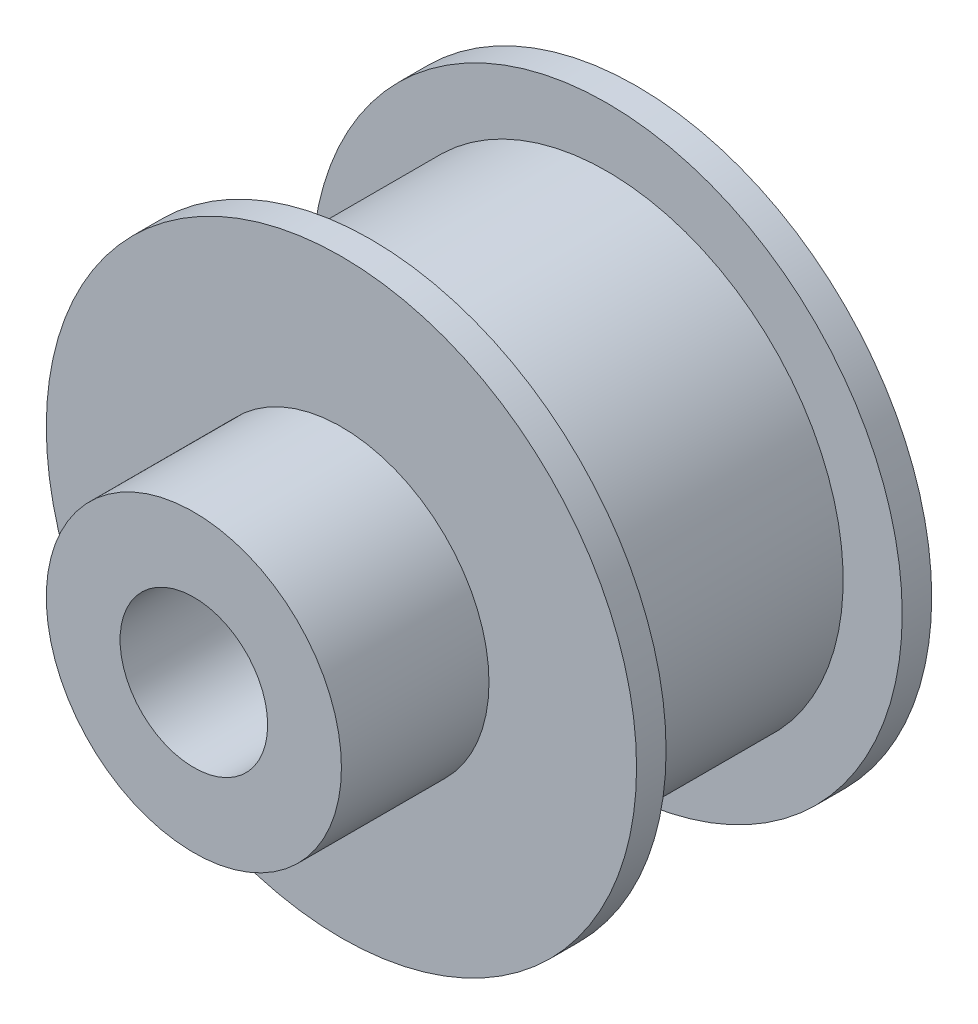
ISO-10303-21;
HEADER;
FILE_DESCRIPTION(('STEP AP214'),'2;1');
FILE_NAME('part.step','',(''),(''),'','','');
FILE_SCHEMA(('AUTOMOTIVE_DESIGN { 1 0 10303 214 1 1 1 1 }'));
ENDSEC;
DATA;
#1=APPLICATION_CONTEXT('core data for automotive mechanical design processes');
#2=APPLICATION_PROTOCOL_DEFINITION('international standard','automotive_design',2000,#1);
#3=PRODUCT_CONTEXT('',#1,'mechanical');
#4=PRODUCT('Part','Part','',(#3));
#5=PRODUCT_RELATED_PRODUCT_CATEGORY('part','',(#4));
#6=PRODUCT_DEFINITION_FORMATION('','',#4);
#7=PRODUCT_DEFINITION_CONTEXT('part definition',#1,'design');
#8=PRODUCT_DEFINITION('design','',#6,#7);
#9=PRODUCT_DEFINITION_SHAPE('','',#8);
#10=(LENGTH_UNIT() NAMED_UNIT(*) SI_UNIT(.MILLI.,.METRE.));
#11=(NAMED_UNIT(*) PLANE_ANGLE_UNIT() SI_UNIT($,.RADIAN.));
#12=(NAMED_UNIT(*) SI_UNIT($,.STERADIAN.) SOLID_ANGLE_UNIT());
#13=UNCERTAINTY_MEASURE_WITH_UNIT(LENGTH_MEASURE(1.E-05),#10,'distance_accuracy_value','');
#14=(GEOMETRIC_REPRESENTATION_CONTEXT(3) GLOBAL_UNCERTAINTY_ASSIGNED_CONTEXT((#13)) GLOBAL_UNIT_ASSIGNED_CONTEXT((#10,
#11,#12)) REPRESENTATION_CONTEXT('',''));
#15=CARTESIAN_POINT('',(0.,0.,0.));
#16=DIRECTION('',(0.,0.,1.));
#17=DIRECTION('',(1.,0.,0.));
#18=AXIS2_PLACEMENT_3D('',#15,#16,#17);
#19=CARTESIAN_POINT('',(0.,0.,10.));
#20=DIRECTION('',(0.,0.,-1.));
#21=DIRECTION('',(-1.,0.,0.));
#22=AXIS2_PLACEMENT_3D('',#19,#20,#21);
#23=CYLINDRICAL_SURFACE('',#22,10.);
#24=CARTESIAN_POINT('',(0.,0.,1.));
#25=DIRECTION('',(0.,0.,-1.));
#26=DIRECTION('',(-1.,0.,0.));
#27=AXIS2_PLACEMENT_3D('',#24,#25,#26);
#28=CIRCLE('',#27,10.);
#29=CARTESIAN_POINT('',(-10.,0.,1.));
#30=VERTEX_POINT('',#29);
#31=EDGE_CURVE('E64',#30,#30,#28,.T.);
#32=ORIENTED_EDGE('',*,*,#31,.T.);
#33=EDGE_LOOP('',(#32));
#34=FACE_BOUND('',#33,.T.);
#35=CARTESIAN_POINT('',(0.,0.,0.));
#36=DIRECTION('',(0.,0.,1.));
#37=DIRECTION('',(1.,0.,0.));
#38=AXIS2_PLACEMENT_3D('',#35,#36,#37);
#39=CIRCLE('',#38,10.);
#40=CARTESIAN_POINT('',(10.,0.,0.));
#41=VERTEX_POINT('',#40);
#42=EDGE_CURVE('E36',#41,#41,#39,.T.);
#43=ORIENTED_EDGE('',*,*,#42,.T.);
#44=EDGE_LOOP('',(#43));
#45=FACE_BOUND('',#44,.T.);
#46=ADVANCED_FACE('F32',(#34,#45),#23,.T.);
#47=CARTESIAN_POINT('',(0.,0.,9.));
#48=DIRECTION('',(0.,0.,-1.));
#49=DIRECTION('',(-1.,0.,0.));
#50=AXIS2_PLACEMENT_3D('',#47,#48,#49);
#51=CIRCLE('',#50,10.);
#52=CARTESIAN_POINT('',(-10.,0.,9.));
#53=VERTEX_POINT('',#52);
#54=EDGE_CURVE('E61',#53,#53,#51,.T.);
#55=ORIENTED_EDGE('',*,*,#54,.F.);
#56=EDGE_LOOP('',(#55));
#57=FACE_BOUND('',#56,.T.);
#58=CARTESIAN_POINT('',(0.,0.,10.));
#59=DIRECTION('',(0.,0.,1.));
#60=DIRECTION('',(1.,0.,0.));
#61=AXIS2_PLACEMENT_3D('',#58,#59,#60);
#62=CIRCLE('',#61,10.);
#63=CARTESIAN_POINT('',(10.,0.,10.));
#64=VERTEX_POINT('',#63);
#65=EDGE_CURVE('E40',#64,#64,#62,.T.);
#66=ORIENTED_EDGE('',*,*,#65,.F.);
#67=EDGE_LOOP('',(#66));
#68=FACE_BOUND('',#67,.T.);
#69=ADVANCED_FACE('F34',(#57,#68),#23,.T.);
#70=CARTESIAN_POINT('',(0.,0.,10.));
#71=DIRECTION('',(0.,0.,1.));
#72=DIRECTION('',(1.,0.,0.));
#73=AXIS2_PLACEMENT_3D('',#70,#71,#72);
#74=PLANE('',#73);
#75=CARTESIAN_POINT('',(0.,0.,10.));
#76=DIRECTION('',(0.,0.,1.));
#77=DIRECTION('',(1.,0.,0.));
#78=AXIS2_PLACEMENT_3D('',#75,#76,#77);
#79=CIRCLE('',#78,5.);
#80=CARTESIAN_POINT('',(5.,0.,10.));
#81=VERTEX_POINT('',#80);
#82=EDGE_CURVE('E10',#81,#81,#79,.T.);
#83=ORIENTED_EDGE('',*,*,#82,.F.);
#84=EDGE_LOOP('',(#83));
#85=FACE_BOUND('',#84,.T.);
#86=ORIENTED_EDGE('',*,*,#65,.T.);
#87=EDGE_LOOP('',(#86));
#88=FACE_BOUND('',#87,.T.);
#89=ADVANCED_FACE('F91',(#85,#88),#74,.T.);
#90=CARTESIAN_POINT('',(0.,0.,0.));
#91=DIRECTION('',(0.,0.,1.));
#92=DIRECTION('',(1.,0.,0.));
#93=AXIS2_PLACEMENT_3D('',#90,#91,#92);
#94=PLANE('',#93);
#95=CARTESIAN_POINT('',(0.,0.,0.));
#96=DIRECTION('',(0.,0.,1.));
#97=DIRECTION('',(1.,0.,0.));
#98=AXIS2_PLACEMENT_3D('',#95,#96,#97);
#99=CIRCLE('',#98,2.5);
#100=CARTESIAN_POINT('',(2.5,0.,0.));
#101=VERTEX_POINT('',#100);
#102=EDGE_CURVE('E49',#101,#101,#99,.T.);
#103=ORIENTED_EDGE('',*,*,#102,.T.);
#104=EDGE_LOOP('',(#103));
#105=FACE_BOUND('',#104,.T.);
#106=ORIENTED_EDGE('',*,*,#42,.F.);
#107=EDGE_LOOP('',(#106));
#108=FACE_BOUND('',#107,.T.);
#109=ADVANCED_FACE('F95',(#105,#108),#94,.F.);
#110=CARTESIAN_POINT('',(0.,0.,15.));
#111=DIRECTION('',(0.,0.,-1.));
#112=DIRECTION('',(-1.,0.,0.));
#113=AXIS2_PLACEMENT_3D('',#110,#111,#112);
#114=CYLINDRICAL_SURFACE('',#113,5.);
#115=CARTESIAN_POINT('',(0.,0.,15.));
#116=DIRECTION('',(0.,0.,1.));
#117=DIRECTION('',(1.,0.,0.));
#118=AXIS2_PLACEMENT_3D('',#115,#116,#117);
#119=CIRCLE('',#118,5.);
#120=CARTESIAN_POINT('',(5.,0.,15.));
#121=VERTEX_POINT('',#120);
#122=EDGE_CURVE('E46',#121,#121,#119,.T.);
#123=ORIENTED_EDGE('',*,*,#122,.F.);
#124=EDGE_LOOP('',(#123));
#125=FACE_BOUND('',#124,.T.);
#126=ORIENTED_EDGE('',*,*,#82,.T.);
#127=EDGE_LOOP('',(#126));
#128=FACE_BOUND('',#127,.T.);
#129=ADVANCED_FACE('F101',(#125,#128),#114,.T.);
#130=CARTESIAN_POINT('',(0.,0.,15.));
#131=DIRECTION('',(0.,0.,1.));
#132=DIRECTION('',(1.,0.,0.));
#133=AXIS2_PLACEMENT_3D('',#130,#131,#132);
#134=PLANE('',#133);
#135=CARTESIAN_POINT('',(0.,0.,15.));
#136=DIRECTION('',(0.,0.,1.));
#137=DIRECTION('',(1.,0.,0.));
#138=AXIS2_PLACEMENT_3D('',#135,#136,#137);
#139=CIRCLE('',#138,2.5);
#140=CARTESIAN_POINT('',(2.5,0.,15.));
#141=VERTEX_POINT('',#140);
#142=EDGE_CURVE('E50',#141,#141,#139,.T.);
#143=ORIENTED_EDGE('',*,*,#142,.F.);
#144=EDGE_LOOP('',(#143));
#145=FACE_BOUND('',#144,.T.);
#146=ORIENTED_EDGE('',*,*,#122,.T.);
#147=EDGE_LOOP('',(#146));
#148=FACE_BOUND('',#147,.T.);
#149=ADVANCED_FACE('F138',(#145,#148),#134,.T.);
#150=CARTESIAN_POINT('',(0.,0.,0.));
#151=DIRECTION('',(0.,0.,1.));
#152=DIRECTION('',(1.,0.,0.));
#153=AXIS2_PLACEMENT_3D('',#150,#151,#152);
#154=CYLINDRICAL_SURFACE('',#153,2.5);
#155=ORIENTED_EDGE('',*,*,#102,.F.);
#156=EDGE_LOOP('',(#155));
#157=FACE_BOUND('',#156,.T.);
#158=ORIENTED_EDGE('',*,*,#142,.T.);
#159=EDGE_LOOP('',(#158));
#160=FACE_BOUND('',#159,.T.);
#161=ADVANCED_FACE('F74',(#157,#160),#154,.F.);
#162=CARTESIAN_POINT('',(0.,10.,1.));
#163=DIRECTION('',(0.,0.,-1.));
#164=DIRECTION('',(-1.,0.,0.));
#165=AXIS2_PLACEMENT_3D('',#162,#163,#164);
#166=PLANE('',#165);
#167=ORIENTED_EDGE('',*,*,#31,.F.);
#168=EDGE_LOOP('',(#167));
#169=FACE_BOUND('',#168,.T.);
#170=CARTESIAN_POINT('',(0.,0.,1.));
#171=DIRECTION('',(0.,0.,-1.));
#172=DIRECTION('',(-1.,0.,0.));
#173=AXIS2_PLACEMENT_3D('',#170,#171,#172);
#174=CIRCLE('',#173,8.);
#175=CARTESIAN_POINT('',(-8.,0.,1.));
#176=VERTEX_POINT('',#175);
#177=EDGE_CURVE('E53',#176,#176,#174,.T.);
#178=ORIENTED_EDGE('',*,*,#177,.T.);
#179=EDGE_LOOP('',(#178));
#180=FACE_BOUND('',#179,.T.);
#181=ADVANCED_FACE('F70',(#169,#180),#166,.F.);
#182=CARTESIAN_POINT('',(0.,0.,0.));
#183=DIRECTION('',(0.,0.,-1.));
#184=DIRECTION('',(-1.,0.,0.));
#185=AXIS2_PLACEMENT_3D('',#182,#183,#184);
#186=CYLINDRICAL_SURFACE('',#185,8.);
#187=ORIENTED_EDGE('',*,*,#177,.F.);
#188=EDGE_LOOP('',(#187));
#189=FACE_BOUND('',#188,.T.);
#190=CARTESIAN_POINT('',(0.,0.,9.));
#191=DIRECTION('',(0.,0.,-1.));
#192=DIRECTION('',(-1.,0.,0.));
#193=AXIS2_PLACEMENT_3D('',#190,#191,#192);
#194=CIRCLE('',#193,8.);
#195=CARTESIAN_POINT('',(-8.,0.,9.));
#196=VERTEX_POINT('',#195);
#197=EDGE_CURVE('E58',#196,#196,#194,.T.);
#198=ORIENTED_EDGE('',*,*,#197,.T.);
#199=EDGE_LOOP('',(#198));
#200=FACE_BOUND('',#199,.T.);
#201=ADVANCED_FACE('F73',(#189,#200),#186,.T.);
#202=CARTESIAN_POINT('',(0.,10.,9.));
#203=DIRECTION('',(0.,0.,1.));
#204=DIRECTION('',(1.,0.,0.));
#205=AXIS2_PLACEMENT_3D('',#202,#203,#204);
#206=PLANE('',#205);
#207=ORIENTED_EDGE('',*,*,#197,.F.);
#208=EDGE_LOOP('',(#207));
#209=FACE_BOUND('',#208,.T.);
#210=ORIENTED_EDGE('',*,*,#54,.T.);
#211=EDGE_LOOP('',(#210));
#212=FACE_BOUND('',#211,.T.);
#213=ADVANCED_FACE('F80',(#209,#212),#206,.F.);
#214=CLOSED_SHELL('',(#46,#69,#89,#109,#129,#149,#161,#181,#201,#213));
#215=MANIFOLD_SOLID_BREP('B2',#214);
#216=ADVANCED_BREP_SHAPE_REPRESENTATION('',(#18,#215),#14);
#217=SHAPE_DEFINITION_REPRESENTATION(#9,#216);
ENDSEC;
END-ISO-10303-21;
